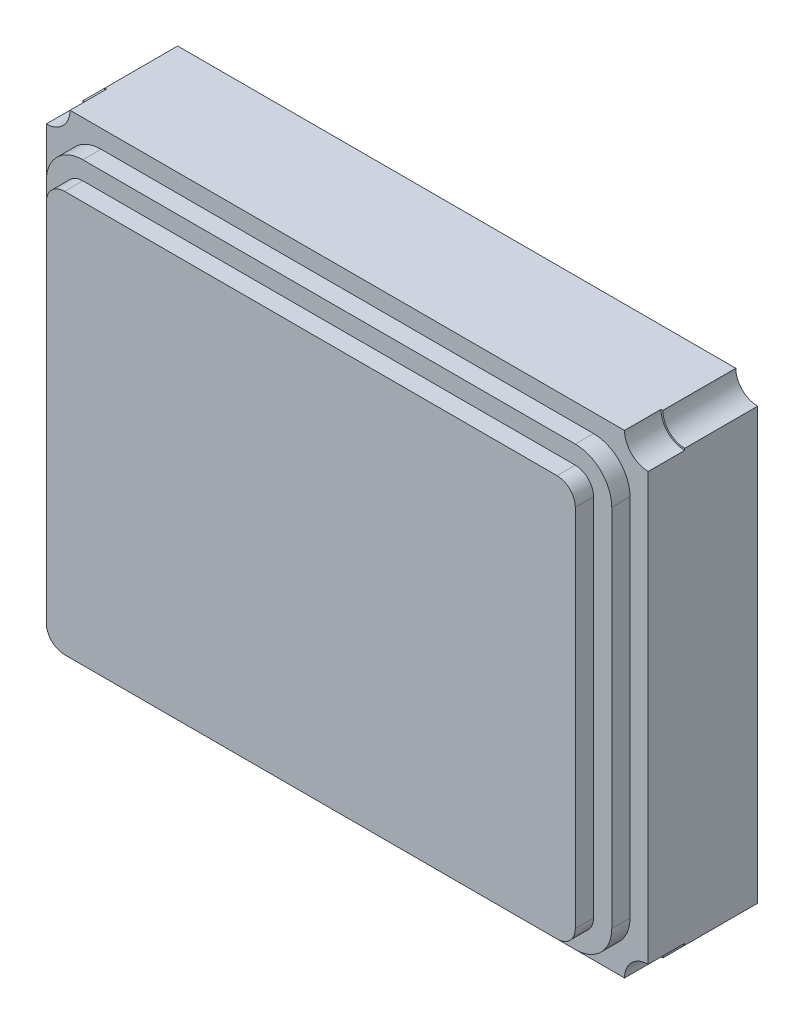
ISO-10303-21;
HEADER;
FILE_DESCRIPTION(('STEP AP214'),'2;1');
FILE_NAME('part.step','',(''),(''),'','','');
FILE_SCHEMA(('AUTOMOTIVE_DESIGN { 1 0 10303 214 1 1 1 1 }'));
ENDSEC;
DATA;
#1=APPLICATION_CONTEXT('core data for automotive mechanical design processes');
#2=APPLICATION_PROTOCOL_DEFINITION('international standard','automotive_design',2000,#1);
#3=PRODUCT_CONTEXT('',#1,'mechanical');
#4=PRODUCT('Part','Part','',(#3));
#5=PRODUCT_RELATED_PRODUCT_CATEGORY('part','',(#4));
#6=PRODUCT_DEFINITION_FORMATION('','',#4);
#7=PRODUCT_DEFINITION_CONTEXT('part definition',#1,'design');
#8=PRODUCT_DEFINITION('design','',#6,#7);
#9=PRODUCT_DEFINITION_SHAPE('','',#8);
#10=(LENGTH_UNIT() NAMED_UNIT(*) SI_UNIT(.MILLI.,.METRE.));
#11=(NAMED_UNIT(*) PLANE_ANGLE_UNIT() SI_UNIT($,.RADIAN.));
#12=(NAMED_UNIT(*) SI_UNIT($,.STERADIAN.) SOLID_ANGLE_UNIT());
#13=UNCERTAINTY_MEASURE_WITH_UNIT(LENGTH_MEASURE(1.E-05),#10,'distance_accuracy_value','');
#14=(GEOMETRIC_REPRESENTATION_CONTEXT(3) GLOBAL_UNCERTAINTY_ASSIGNED_CONTEXT((#13)) GLOBAL_UNIT_ASSIGNED_CONTEXT((#10,
#11,#12)) REPRESENTATION_CONTEXT('',''));
#15=CARTESIAN_POINT('',(0.,0.,0.));
#16=DIRECTION('',(0.,0.,1.));
#17=DIRECTION('',(1.,0.,0.));
#18=AXIS2_PLACEMENT_3D('',#15,#16,#17);
#19=CARTESIAN_POINT('',(1.65,-1.3,0.8));
#20=DIRECTION('',(0.,0.,-1.));
#21=DIRECTION('',(-1.,0.,0.));
#22=AXIS2_PLACEMENT_3D('',#19,#20,#21);
#23=CYLINDRICAL_SURFACE('',#22,0.12);
#24=DIRECTION('',(0.,0.,-1.));
#25=VECTOR('',#24,1.);
#26=CARTESIAN_POINT('',(1.65,-1.18,0.8));
#27=LINE('',#26,#25);
#28=CARTESIAN_POINT('',(1.65,-1.18,0.4));
#29=VERTEX_POINT('',#28);
#30=CARTESIAN_POINT('',(1.65,-1.18,0.));
#31=VERTEX_POINT('',#30);
#32=EDGE_CURVE('E11',#29,#31,#27,.T.);
#33=ORIENTED_EDGE('',*,*,#32,.F.);
#34=CARTESIAN_POINT('',(1.65,-1.3,0.4));
#35=DIRECTION('',(0.,0.,1.));
#36=DIRECTION('',(1.,0.,0.));
#37=AXIS2_PLACEMENT_3D('',#34,#35,#36);
#38=CIRCLE('',#37,0.12);
#39=CARTESIAN_POINT('',(1.53,-1.3,0.4));
#40=VERTEX_POINT('',#39);
#41=EDGE_CURVE('E24',#29,#40,#38,.T.);
#42=ORIENTED_EDGE('',*,*,#41,.T.);
#43=DIRECTION('',(0.,0.,-1.));
#44=VECTOR('',#43,1.);
#45=CARTESIAN_POINT('',(1.53,-1.3,0.8));
#46=LINE('',#45,#44);
#47=CARTESIAN_POINT('',(1.53,-1.3,0.));
#48=VERTEX_POINT('',#47);
#49=EDGE_CURVE('E492',#40,#48,#46,.T.);
#50=ORIENTED_EDGE('',*,*,#49,.T.);
#51=CARTESIAN_POINT('',(1.65,-1.3,0.));
#52=DIRECTION('',(0.,0.,1.));
#53=DIRECTION('',(1.,0.,0.));
#54=AXIS2_PLACEMENT_3D('',#51,#52,#53);
#55=CIRCLE('',#54,0.12);
#56=EDGE_CURVE('E37',#31,#48,#55,.T.);
#57=ORIENTED_EDGE('',*,*,#56,.F.);
#58=EDGE_LOOP('',(#33,#42,#50,#57));
#59=FACE_BOUND('',#58,.T.);
#60=ADVANCED_FACE('F17',(#59),#23,.F.);
#61=CARTESIAN_POINT('',(-1.65,1.3,0.8));
#62=DIRECTION('',(0.,0.,-1.));
#63=DIRECTION('',(-1.,0.,0.));
#64=AXIS2_PLACEMENT_3D('',#61,#62,#63);
#65=CYLINDRICAL_SURFACE('',#64,0.12);
#66=DIRECTION('',(0.,0.,-1.));
#67=VECTOR('',#66,1.);
#68=CARTESIAN_POINT('',(-1.65,1.18,0.8));
#69=LINE('',#68,#67);
#70=CARTESIAN_POINT('',(-1.65,1.18,0.4));
#71=VERTEX_POINT('',#70);
#72=CARTESIAN_POINT('',(-1.65,1.18,0.));
#73=VERTEX_POINT('',#72);
#74=EDGE_CURVE('E488',#71,#73,#69,.T.);
#75=ORIENTED_EDGE('',*,*,#74,.F.);
#76=CARTESIAN_POINT('',(-1.65,1.3,0.4));
#77=DIRECTION('',(0.,0.,1.));
#78=DIRECTION('',(1.,0.,0.));
#79=AXIS2_PLACEMENT_3D('',#76,#77,#78);
#80=CIRCLE('',#79,0.12);
#81=CARTESIAN_POINT('',(-1.53,1.3,0.4));
#82=VERTEX_POINT('',#81);
#83=EDGE_CURVE('E485',#71,#82,#80,.T.);
#84=ORIENTED_EDGE('',*,*,#83,.T.);
#85=DIRECTION('',(0.,0.,-1.));
#86=VECTOR('',#85,1.);
#87=CARTESIAN_POINT('',(-1.53,1.3,0.8));
#88=LINE('',#87,#86);
#89=CARTESIAN_POINT('',(-1.53,1.3,0.));
#90=VERTEX_POINT('',#89);
#91=EDGE_CURVE('E482',#82,#90,#88,.T.);
#92=ORIENTED_EDGE('',*,*,#91,.T.);
#93=CARTESIAN_POINT('',(-1.65,1.3,0.));
#94=DIRECTION('',(0.,0.,1.));
#95=DIRECTION('',(1.,0.,0.));
#96=AXIS2_PLACEMENT_3D('',#93,#94,#95);
#97=CIRCLE('',#96,0.12);
#98=EDGE_CURVE('E480',#73,#90,#97,.T.);
#99=ORIENTED_EDGE('',*,*,#98,.F.);
#100=EDGE_LOOP('',(#75,#84,#92,#99));
#101=FACE_BOUND('',#100,.T.);
#102=ADVANCED_FACE('F531',(#101),#65,.F.);
#103=CARTESIAN_POINT('',(1.65,1.3,0.8));
#104=DIRECTION('',(0.,0.,-1.));
#105=DIRECTION('',(-1.,0.,0.));
#106=AXIS2_PLACEMENT_3D('',#103,#104,#105);
#107=CYLINDRICAL_SURFACE('',#106,0.12);
#108=DIRECTION('',(0.,0.,-1.));
#109=VECTOR('',#108,1.);
#110=CARTESIAN_POINT('',(1.53,1.3,0.8));
#111=LINE('',#110,#109);
#112=CARTESIAN_POINT('',(1.53,1.3,0.4));
#113=VERTEX_POINT('',#112);
#114=CARTESIAN_POINT('',(1.53,1.3,0.));
#115=VERTEX_POINT('',#114);
#116=EDGE_CURVE('E477',#113,#115,#111,.T.);
#117=ORIENTED_EDGE('',*,*,#116,.F.);
#118=CARTESIAN_POINT('',(1.65,1.3,0.4));
#119=DIRECTION('',(0.,0.,1.));
#120=DIRECTION('',(1.,0.,0.));
#121=AXIS2_PLACEMENT_3D('',#118,#119,#120);
#122=CIRCLE('',#121,0.12);
#123=CARTESIAN_POINT('',(1.65,1.18,0.4));
#124=VERTEX_POINT('',#123);
#125=EDGE_CURVE('E474',#113,#124,#122,.T.);
#126=ORIENTED_EDGE('',*,*,#125,.T.);
#127=DIRECTION('',(0.,0.,-1.));
#128=VECTOR('',#127,1.);
#129=CARTESIAN_POINT('',(1.65,1.18,0.8));
#130=LINE('',#129,#128);
#131=CARTESIAN_POINT('',(1.65,1.18,0.));
#132=VERTEX_POINT('',#131);
#133=EDGE_CURVE('E471',#124,#132,#130,.T.);
#134=ORIENTED_EDGE('',*,*,#133,.T.);
#135=CARTESIAN_POINT('',(1.65,1.3,0.));
#136=DIRECTION('',(0.,0.,1.));
#137=DIRECTION('',(1.,0.,0.));
#138=AXIS2_PLACEMENT_3D('',#135,#136,#137);
#139=CIRCLE('',#138,0.12);
#140=EDGE_CURVE('E469',#115,#132,#139,.T.);
#141=ORIENTED_EDGE('',*,*,#140,.F.);
#142=EDGE_LOOP('',(#117,#126,#134,#141));
#143=FACE_BOUND('',#142,.T.);
#144=ADVANCED_FACE('F527',(#143),#107,.F.);
#145=CARTESIAN_POINT('',(0.,0.,0.7));
#146=DIRECTION('',(0.,0.,1.));
#147=DIRECTION('',(1.,0.,0.));
#148=AXIS2_PLACEMENT_3D('',#145,#146,#147);
#149=PLANE('',#148);
#150=DIRECTION('',(1.,0.,0.));
#151=VECTOR('',#150,1.);
#152=CARTESIAN_POINT('',(-1.35,-1.1,0.7));
#153=LINE('',#152,#151);
#154=CARTESIAN_POINT('',(-1.35,-1.1,0.7));
#155=VERTEX_POINT('',#154);
#156=CARTESIAN_POINT('',(1.35,-1.1,0.7));
#157=VERTEX_POINT('',#156);
#158=EDGE_CURVE('E467',#155,#157,#153,.T.);
#159=ORIENTED_EDGE('',*,*,#158,.F.);
#160=CARTESIAN_POINT('',(-1.35,-1.,0.7));
#161=DIRECTION('',(0.,0.,1.));
#162=DIRECTION('',(-1.,0.,0.));
#163=AXIS2_PLACEMENT_3D('',#160,#161,#162);
#164=CIRCLE('',#163,0.0999999999999998);
#165=CARTESIAN_POINT('',(-1.45,-1.,0.7));
#166=VERTEX_POINT('',#165);
#167=EDGE_CURVE('E464',#166,#155,#164,.T.);
#168=ORIENTED_EDGE('',*,*,#167,.F.);
#169=DIRECTION('',(0.,-1.,0.));
#170=VECTOR('',#169,1.);
#171=CARTESIAN_POINT('',(-1.45,-1.,0.7));
#172=LINE('',#171,#170);
#173=CARTESIAN_POINT('',(-1.45,1.,0.7));
#174=VERTEX_POINT('',#173);
#175=EDGE_CURVE('E461',#174,#166,#172,.T.);
#176=ORIENTED_EDGE('',*,*,#175,.F.);
#177=CARTESIAN_POINT('',(-1.35,1.,0.7));
#178=DIRECTION('',(0.,0.,1.));
#179=DIRECTION('',(-1.,0.,0.));
#180=AXIS2_PLACEMENT_3D('',#177,#178,#179);
#181=CIRCLE('',#180,0.0999999999999998);
#182=CARTESIAN_POINT('',(-1.35,1.1,0.7));
#183=VERTEX_POINT('',#182);
#184=EDGE_CURVE('E458',#183,#174,#181,.T.);
#185=ORIENTED_EDGE('',*,*,#184,.F.);
#186=DIRECTION('',(-1.,0.,0.));
#187=VECTOR('',#186,1.);
#188=CARTESIAN_POINT('',(-1.35,1.1,0.7));
#189=LINE('',#188,#187);
#190=CARTESIAN_POINT('',(1.35,1.1,0.7));
#191=VERTEX_POINT('',#190);
#192=EDGE_CURVE('E455',#191,#183,#189,.T.);
#193=ORIENTED_EDGE('',*,*,#192,.F.);
#194=CARTESIAN_POINT('',(1.35,1.,0.7));
#195=DIRECTION('',(0.,0.,1.));
#196=DIRECTION('',(-1.,0.,0.));
#197=AXIS2_PLACEMENT_3D('',#194,#195,#196);
#198=CIRCLE('',#197,0.0999999999999998);
#199=CARTESIAN_POINT('',(1.45,1.,0.7));
#200=VERTEX_POINT('',#199);
#201=EDGE_CURVE('E452',#200,#191,#198,.T.);
#202=ORIENTED_EDGE('',*,*,#201,.F.);
#203=DIRECTION('',(0.,1.,0.));
#204=VECTOR('',#203,1.);
#205=CARTESIAN_POINT('',(1.45,-1.,0.7));
#206=LINE('',#205,#204);
#207=CARTESIAN_POINT('',(1.45,-1.,0.7));
#208=VERTEX_POINT('',#207);
#209=EDGE_CURVE('E449',#208,#200,#206,.T.);
#210=ORIENTED_EDGE('',*,*,#209,.F.);
#211=CARTESIAN_POINT('',(1.35,-1.,0.7));
#212=DIRECTION('',(0.,0.,1.));
#213=DIRECTION('',(1.,0.,0.));
#214=AXIS2_PLACEMENT_3D('',#211,#212,#213);
#215=CIRCLE('',#214,0.0999999999999998);
#216=EDGE_CURVE('E446',#157,#208,#215,.T.);
#217=ORIENTED_EDGE('',*,*,#216,.F.);
#218=EDGE_LOOP('',(#159,#168,#176,#185,#193,#202,#210,#217));
#219=FACE_BOUND('',#218,.T.);
#220=DIRECTION('',(1.,0.,0.));
#221=VECTOR('',#220,1.);
#222=CARTESIAN_POINT('',(0.,-1.2,0.7));
#223=LINE('',#222,#221);
#224=CARTESIAN_POINT('',(-1.35,-1.2,0.7));
#225=VERTEX_POINT('',#224);
#226=CARTESIAN_POINT('',(1.35,-1.2,0.7));
#227=VERTEX_POINT('',#226);
#228=EDGE_CURVE('E444',#225,#227,#223,.T.);
#229=ORIENTED_EDGE('',*,*,#228,.T.);
#230=CARTESIAN_POINT('',(1.35,-1.,0.7));
#231=DIRECTION('',(0.,0.,1.));
#232=DIRECTION('',(1.,0.,0.));
#233=AXIS2_PLACEMENT_3D('',#230,#231,#232);
#234=CIRCLE('',#233,0.199999999999999);
#235=CARTESIAN_POINT('',(1.55,-1.,0.7));
#236=VERTEX_POINT('',#235);
#237=EDGE_CURVE('E442',#227,#236,#234,.T.);
#238=ORIENTED_EDGE('',*,*,#237,.T.);
#239=DIRECTION('',(0.,1.,0.));
#240=VECTOR('',#239,1.);
#241=CARTESIAN_POINT('',(1.55,0.,0.7));
#242=LINE('',#241,#240);
#243=CARTESIAN_POINT('',(1.55,1.,0.7));
#244=VERTEX_POINT('',#243);
#245=EDGE_CURVE('E440',#236,#244,#242,.T.);
#246=ORIENTED_EDGE('',*,*,#245,.T.);
#247=CARTESIAN_POINT('',(1.35,1.,0.7));
#248=DIRECTION('',(0.,0.,1.));
#249=DIRECTION('',(1.,0.,0.));
#250=AXIS2_PLACEMENT_3D('',#247,#248,#249);
#251=CIRCLE('',#250,0.199999999999999);
#252=CARTESIAN_POINT('',(1.35,1.2,0.7));
#253=VERTEX_POINT('',#252);
#254=EDGE_CURVE('E438',#244,#253,#251,.T.);
#255=ORIENTED_EDGE('',*,*,#254,.T.);
#256=DIRECTION('',(-1.,0.,0.));
#257=VECTOR('',#256,1.);
#258=CARTESIAN_POINT('',(0.,1.2,0.7));
#259=LINE('',#258,#257);
#260=CARTESIAN_POINT('',(-1.35,1.2,0.7));
#261=VERTEX_POINT('',#260);
#262=EDGE_CURVE('E436',#253,#261,#259,.T.);
#263=ORIENTED_EDGE('',*,*,#262,.T.);
#264=CARTESIAN_POINT('',(-1.35,1.,0.7));
#265=DIRECTION('',(0.,0.,1.));
#266=DIRECTION('',(1.,0.,0.));
#267=AXIS2_PLACEMENT_3D('',#264,#265,#266);
#268=CIRCLE('',#267,0.199999999999999);
#269=CARTESIAN_POINT('',(-1.55,1.,0.7));
#270=VERTEX_POINT('',#269);
#271=EDGE_CURVE('E434',#261,#270,#268,.T.);
#272=ORIENTED_EDGE('',*,*,#271,.T.);
#273=DIRECTION('',(0.,-1.,0.));
#274=VECTOR('',#273,1.);
#275=CARTESIAN_POINT('',(-1.55,0.,0.7));
#276=LINE('',#275,#274);
#277=CARTESIAN_POINT('',(-1.55,-1.,0.7));
#278=VERTEX_POINT('',#277);
#279=EDGE_CURVE('E432',#270,#278,#276,.T.);
#280=ORIENTED_EDGE('',*,*,#279,.T.);
#281=CARTESIAN_POINT('',(-1.35,-1.,0.7));
#282=DIRECTION('',(0.,0.,1.));
#283=DIRECTION('',(1.,0.,0.));
#284=AXIS2_PLACEMENT_3D('',#281,#282,#283);
#285=CIRCLE('',#284,0.199999999999999);
#286=EDGE_CURVE('E429',#278,#225,#285,.T.);
#287=ORIENTED_EDGE('',*,*,#286,.T.);
#288=EDGE_LOOP('',(#229,#238,#246,#255,#263,#272,#280,#287));
#289=FACE_BOUND('',#288,.T.);
#290=ADVANCED_FACE('F555',(#219,#289),#149,.T.);
#291=CARTESIAN_POINT('',(1.35,-1.,0.7));
#292=DIRECTION('',(0.,0.,1.));
#293=DIRECTION('',(1.,0.,0.));
#294=AXIS2_PLACEMENT_3D('',#291,#292,#293);
#295=CYLINDRICAL_SURFACE('',#294,0.0999999999999998);
#296=CARTESIAN_POINT('',(1.35,-1.,0.8));
#297=DIRECTION('',(0.,0.,1.));
#298=DIRECTION('',(1.,0.,0.));
#299=AXIS2_PLACEMENT_3D('',#296,#297,#298);
#300=CIRCLE('',#299,0.0999999999999998);
#301=CARTESIAN_POINT('',(1.35,-1.1,0.8));
#302=VERTEX_POINT('',#301);
#303=CARTESIAN_POINT('',(1.45,-1.,0.8));
#304=VERTEX_POINT('',#303);
#305=EDGE_CURVE('E427',#302,#304,#300,.T.);
#306=ORIENTED_EDGE('',*,*,#305,.F.);
#307=DIRECTION('',(0.,0.,1.));
#308=VECTOR('',#307,1.);
#309=CARTESIAN_POINT('',(1.35,-1.1,0.7));
#310=LINE('',#309,#308);
#311=EDGE_CURVE('E424',#157,#302,#310,.T.);
#312=ORIENTED_EDGE('',*,*,#311,.F.);
#313=ORIENTED_EDGE('',*,*,#216,.T.);
#314=DIRECTION('',(0.,0.,1.));
#315=VECTOR('',#314,1.);
#316=CARTESIAN_POINT('',(1.45,-1.,0.7));
#317=LINE('',#316,#315);
#318=EDGE_CURVE('E421',#208,#304,#317,.T.);
#319=ORIENTED_EDGE('',*,*,#318,.T.);
#320=EDGE_LOOP('',(#306,#312,#313,#319));
#321=FACE_BOUND('',#320,.T.);
#322=ADVANCED_FACE('F560',(#321),#295,.T.);
#323=CARTESIAN_POINT('',(-1.35,-1.1,0.7));
#324=DIRECTION('',(0.,-1.,0.));
#325=DIRECTION('',(0.,0.,-1.));
#326=AXIS2_PLACEMENT_3D('',#323,#324,#325);
#327=PLANE('',#326);
#328=DIRECTION('',(1.,0.,0.));
#329=VECTOR('',#328,1.);
#330=CARTESIAN_POINT('',(-1.35,-1.1,0.8));
#331=LINE('',#330,#329);
#332=CARTESIAN_POINT('',(-1.35,-1.1,0.8));
#333=VERTEX_POINT('',#332);
#334=EDGE_CURVE('E418',#333,#302,#331,.T.);
#335=ORIENTED_EDGE('',*,*,#334,.F.);
#336=DIRECTION('',(0.,0.,1.));
#337=VECTOR('',#336,1.);
#338=CARTESIAN_POINT('',(-1.35,-1.1,0.7));
#339=LINE('',#338,#337);
#340=EDGE_CURVE('E415',#155,#333,#339,.T.);
#341=ORIENTED_EDGE('',*,*,#340,.F.);
#342=ORIENTED_EDGE('',*,*,#158,.T.);
#343=ORIENTED_EDGE('',*,*,#311,.T.);
#344=EDGE_LOOP('',(#335,#341,#342,#343));
#345=FACE_BOUND('',#344,.T.);
#346=ADVANCED_FACE('F564',(#345),#327,.T.);
#347=CARTESIAN_POINT('',(-1.35,-1.,0.7));
#348=DIRECTION('',(0.,0.,1.));
#349=DIRECTION('',(1.,0.,0.));
#350=AXIS2_PLACEMENT_3D('',#347,#348,#349);
#351=CYLINDRICAL_SURFACE('',#350,0.0999999999999998);
#352=CARTESIAN_POINT('',(-1.35,-1.,0.8));
#353=DIRECTION('',(0.,0.,1.));
#354=DIRECTION('',(-1.,0.,0.));
#355=AXIS2_PLACEMENT_3D('',#352,#353,#354);
#356=CIRCLE('',#355,0.0999999999999998);
#357=CARTESIAN_POINT('',(-1.45,-1.,0.8));
#358=VERTEX_POINT('',#357);
#359=EDGE_CURVE('E412',#358,#333,#356,.T.);
#360=ORIENTED_EDGE('',*,*,#359,.F.);
#361=DIRECTION('',(0.,0.,1.));
#362=VECTOR('',#361,1.);
#363=CARTESIAN_POINT('',(-1.45,-1.,0.7));
#364=LINE('',#363,#362);
#365=EDGE_CURVE('E409',#166,#358,#364,.T.);
#366=ORIENTED_EDGE('',*,*,#365,.F.);
#367=ORIENTED_EDGE('',*,*,#167,.T.);
#368=ORIENTED_EDGE('',*,*,#340,.T.);
#369=EDGE_LOOP('',(#360,#366,#367,#368));
#370=FACE_BOUND('',#369,.T.);
#371=ADVANCED_FACE('F568',(#370),#351,.T.);
#372=CARTESIAN_POINT('',(-1.45,-1.,0.7));
#373=DIRECTION('',(-1.,0.,0.));
#374=DIRECTION('',(0.,0.,1.));
#375=AXIS2_PLACEMENT_3D('',#372,#373,#374);
#376=PLANE('',#375);
#377=DIRECTION('',(0.,-1.,0.));
#378=VECTOR('',#377,1.);
#379=CARTESIAN_POINT('',(-1.45,-1.,0.8));
#380=LINE('',#379,#378);
#381=CARTESIAN_POINT('',(-1.45,1.,0.8));
#382=VERTEX_POINT('',#381);
#383=EDGE_CURVE('E406',#382,#358,#380,.T.);
#384=ORIENTED_EDGE('',*,*,#383,.F.);
#385=DIRECTION('',(0.,0.,1.));
#386=VECTOR('',#385,1.);
#387=CARTESIAN_POINT('',(-1.45,1.,0.7));
#388=LINE('',#387,#386);
#389=EDGE_CURVE('E403',#174,#382,#388,.T.);
#390=ORIENTED_EDGE('',*,*,#389,.F.);
#391=ORIENTED_EDGE('',*,*,#175,.T.);
#392=ORIENTED_EDGE('',*,*,#365,.T.);
#393=EDGE_LOOP('',(#384,#390,#391,#392));
#394=FACE_BOUND('',#393,.T.);
#395=ADVANCED_FACE('F572',(#394),#376,.T.);
#396=CARTESIAN_POINT('',(-1.35,1.,0.7));
#397=DIRECTION('',(0.,0.,1.));
#398=DIRECTION('',(1.,0.,0.));
#399=AXIS2_PLACEMENT_3D('',#396,#397,#398);
#400=CYLINDRICAL_SURFACE('',#399,0.0999999999999998);
#401=CARTESIAN_POINT('',(-1.35,1.,0.8));
#402=DIRECTION('',(0.,0.,1.));
#403=DIRECTION('',(-1.,0.,0.));
#404=AXIS2_PLACEMENT_3D('',#401,#402,#403);
#405=CIRCLE('',#404,0.0999999999999998);
#406=CARTESIAN_POINT('',(-1.35,1.1,0.8));
#407=VERTEX_POINT('',#406);
#408=EDGE_CURVE('E400',#407,#382,#405,.T.);
#409=ORIENTED_EDGE('',*,*,#408,.F.);
#410=DIRECTION('',(0.,0.,1.));
#411=VECTOR('',#410,1.);
#412=CARTESIAN_POINT('',(-1.35,1.1,0.7));
#413=LINE('',#412,#411);
#414=EDGE_CURVE('E397',#183,#407,#413,.T.);
#415=ORIENTED_EDGE('',*,*,#414,.F.);
#416=ORIENTED_EDGE('',*,*,#184,.T.);
#417=ORIENTED_EDGE('',*,*,#389,.T.);
#418=EDGE_LOOP('',(#409,#415,#416,#417));
#419=FACE_BOUND('',#418,.T.);
#420=ADVANCED_FACE('F576',(#419),#400,.T.);
#421=CARTESIAN_POINT('',(-1.35,1.1,0.7));
#422=DIRECTION('',(0.,1.,0.));
#423=DIRECTION('',(0.,0.,1.));
#424=AXIS2_PLACEMENT_3D('',#421,#422,#423);
#425=PLANE('',#424);
#426=DIRECTION('',(-1.,0.,0.));
#427=VECTOR('',#426,1.);
#428=CARTESIAN_POINT('',(-1.35,1.1,0.8));
#429=LINE('',#428,#427);
#430=CARTESIAN_POINT('',(1.35,1.1,0.8));
#431=VERTEX_POINT('',#430);
#432=EDGE_CURVE('E394',#431,#407,#429,.T.);
#433=ORIENTED_EDGE('',*,*,#432,.F.);
#434=DIRECTION('',(0.,0.,1.));
#435=VECTOR('',#434,1.);
#436=CARTESIAN_POINT('',(1.35,1.1,0.7));
#437=LINE('',#436,#435);
#438=EDGE_CURVE('E391',#191,#431,#437,.T.);
#439=ORIENTED_EDGE('',*,*,#438,.F.);
#440=ORIENTED_EDGE('',*,*,#192,.T.);
#441=ORIENTED_EDGE('',*,*,#414,.T.);
#442=EDGE_LOOP('',(#433,#439,#440,#441));
#443=FACE_BOUND('',#442,.T.);
#444=ADVANCED_FACE('F580',(#443),#425,.T.);
#445=CARTESIAN_POINT('',(1.35,1.,0.7));
#446=DIRECTION('',(0.,0.,1.));
#447=DIRECTION('',(1.,0.,0.));
#448=AXIS2_PLACEMENT_3D('',#445,#446,#447);
#449=CYLINDRICAL_SURFACE('',#448,0.0999999999999998);
#450=CARTESIAN_POINT('',(1.35,1.,0.8));
#451=DIRECTION('',(0.,0.,1.));
#452=DIRECTION('',(-1.,0.,0.));
#453=AXIS2_PLACEMENT_3D('',#450,#451,#452);
#454=CIRCLE('',#453,0.0999999999999998);
#455=CARTESIAN_POINT('',(1.45,1.,0.8));
#456=VERTEX_POINT('',#455);
#457=EDGE_CURVE('E388',#456,#431,#454,.T.);
#458=ORIENTED_EDGE('',*,*,#457,.F.);
#459=DIRECTION('',(0.,0.,1.));
#460=VECTOR('',#459,1.);
#461=CARTESIAN_POINT('',(1.45,1.,0.7));
#462=LINE('',#461,#460);
#463=EDGE_CURVE('E385',#200,#456,#462,.T.);
#464=ORIENTED_EDGE('',*,*,#463,.F.);
#465=ORIENTED_EDGE('',*,*,#201,.T.);
#466=ORIENTED_EDGE('',*,*,#438,.T.);
#467=EDGE_LOOP('',(#458,#464,#465,#466));
#468=FACE_BOUND('',#467,.T.);
#469=ADVANCED_FACE('F584',(#468),#449,.T.);
#470=CARTESIAN_POINT('',(1.45,-1.,0.7));
#471=DIRECTION('',(1.,0.,0.));
#472=DIRECTION('',(0.,0.,-1.));
#473=AXIS2_PLACEMENT_3D('',#470,#471,#472);
#474=PLANE('',#473);
#475=DIRECTION('',(0.,1.,0.));
#476=VECTOR('',#475,1.);
#477=CARTESIAN_POINT('',(1.45,-1.,0.8));
#478=LINE('',#477,#476);
#479=EDGE_CURVE('E382',#304,#456,#478,.T.);
#480=ORIENTED_EDGE('',*,*,#479,.F.);
#481=ORIENTED_EDGE('',*,*,#318,.F.);
#482=ORIENTED_EDGE('',*,*,#209,.T.);
#483=ORIENTED_EDGE('',*,*,#463,.T.);
#484=EDGE_LOOP('',(#480,#481,#482,#483));
#485=FACE_BOUND('',#484,.T.);
#486=ADVANCED_FACE('F588',(#485),#474,.T.);
#487=CARTESIAN_POINT('',(0.,0.,0.8));
#488=DIRECTION('',(0.,0.,1.));
#489=DIRECTION('',(1.,0.,0.));
#490=AXIS2_PLACEMENT_3D('',#487,#488,#489);
#491=PLANE('',#490);
#492=ORIENTED_EDGE('',*,*,#334,.T.);
#493=ORIENTED_EDGE('',*,*,#305,.T.);
#494=ORIENTED_EDGE('',*,*,#479,.T.);
#495=ORIENTED_EDGE('',*,*,#457,.T.);
#496=ORIENTED_EDGE('',*,*,#432,.T.);
#497=ORIENTED_EDGE('',*,*,#408,.T.);
#498=ORIENTED_EDGE('',*,*,#383,.T.);
#499=ORIENTED_EDGE('',*,*,#359,.T.);
#500=EDGE_LOOP('',(#492,#493,#494,#495,#496,#497,#498,#499));
#501=FACE_BOUND('',#500,.T.);
#502=ADVANCED_FACE('F592',(#501),#491,.T.);
#503=CARTESIAN_POINT('',(0.,0.,0.6));
#504=DIRECTION('',(0.,0.,1.));
#505=DIRECTION('',(1.,0.,0.));
#506=AXIS2_PLACEMENT_3D('',#503,#504,#505);
#507=PLANE('',#506);
#508=CARTESIAN_POINT('',(1.65,-1.3,0.6));
#509=DIRECTION('',(0.,0.,1.));
#510=DIRECTION('',(1.,0.,0.));
#511=AXIS2_PLACEMENT_3D('',#508,#509,#510);
#512=CIRCLE('',#511,0.13);
#513=CARTESIAN_POINT('',(1.65,-1.17,0.6));
#514=VERTEX_POINT('',#513);
#515=CARTESIAN_POINT('',(1.52,-1.3,0.6));
#516=VERTEX_POINT('',#515);
#517=EDGE_CURVE('E380',#514,#516,#512,.T.);
#518=ORIENTED_EDGE('',*,*,#517,.F.);
#519=DIRECTION('',(0.,1.,0.));
#520=VECTOR('',#519,1.);
#521=CARTESIAN_POINT('',(1.65,0.,0.6));
#522=LINE('',#521,#520);
#523=CARTESIAN_POINT('',(1.65,1.17,0.6));
#524=VERTEX_POINT('',#523);
#525=EDGE_CURVE('E378',#514,#524,#522,.T.);
#526=ORIENTED_EDGE('',*,*,#525,.T.);
#527=CARTESIAN_POINT('',(1.65,1.3,0.6));
#528=DIRECTION('',(0.,0.,1.));
#529=DIRECTION('',(1.,0.,0.));
#530=AXIS2_PLACEMENT_3D('',#527,#528,#529);
#531=CIRCLE('',#530,0.13);
#532=CARTESIAN_POINT('',(1.52,1.3,0.6));
#533=VERTEX_POINT('',#532);
#534=EDGE_CURVE('E375',#533,#524,#531,.T.);
#535=ORIENTED_EDGE('',*,*,#534,.F.);
#536=DIRECTION('',(1.,0.,0.));
#537=VECTOR('',#536,1.);
#538=CARTESIAN_POINT('',(0.,1.3,0.6));
#539=LINE('',#538,#537);
#540=CARTESIAN_POINT('',(-1.52,1.3,0.6));
#541=VERTEX_POINT('',#540);
#542=EDGE_CURVE('E372',#541,#533,#539,.T.);
#543=ORIENTED_EDGE('',*,*,#542,.F.);
#544=CARTESIAN_POINT('',(-1.65,1.3,0.6));
#545=DIRECTION('',(0.,0.,1.));
#546=DIRECTION('',(1.,0.,0.));
#547=AXIS2_PLACEMENT_3D('',#544,#545,#546);
#548=CIRCLE('',#547,0.13);
#549=CARTESIAN_POINT('',(-1.65,1.17,0.6));
#550=VERTEX_POINT('',#549);
#551=EDGE_CURVE('E369',#550,#541,#548,.T.);
#552=ORIENTED_EDGE('',*,*,#551,.F.);
#553=DIRECTION('',(0.,1.,0.));
#554=VECTOR('',#553,1.);
#555=CARTESIAN_POINT('',(-1.65,0.,0.6));
#556=LINE('',#555,#554);
#557=CARTESIAN_POINT('',(-1.65,-1.17,0.6));
#558=VERTEX_POINT('',#557);
#559=EDGE_CURVE('E367',#558,#550,#556,.T.);
#560=ORIENTED_EDGE('',*,*,#559,.F.);
#561=CARTESIAN_POINT('',(-1.65,-1.3,0.6));
#562=DIRECTION('',(0.,0.,1.));
#563=DIRECTION('',(-1.,0.,0.));
#564=AXIS2_PLACEMENT_3D('',#561,#562,#563);
#565=CIRCLE('',#564,0.13);
#566=CARTESIAN_POINT('',(-1.52,-1.3,0.6));
#567=VERTEX_POINT('',#566);
#568=EDGE_CURVE('E244',#567,#558,#565,.T.);
#569=ORIENTED_EDGE('',*,*,#568,.F.);
#570=DIRECTION('',(1.,0.,0.));
#571=VECTOR('',#570,1.);
#572=CARTESIAN_POINT('',(0.,-1.3,0.6));
#573=LINE('',#572,#571);
#574=EDGE_CURVE('E363',#567,#516,#573,.T.);
#575=ORIENTED_EDGE('',*,*,#574,.T.);
#576=EDGE_LOOP('',(#518,#526,#535,#543,#552,#560,#569,#575));
#577=FACE_BOUND('',#576,.T.);
#578=DIRECTION('',(1.,0.,0.));
#579=VECTOR('',#578,1.);
#580=CARTESIAN_POINT('',(-1.35,-1.2,0.6));
#581=LINE('',#580,#579);
#582=CARTESIAN_POINT('',(-1.35,-1.2,0.6));
#583=VERTEX_POINT('',#582);
#584=CARTESIAN_POINT('',(1.35,-1.2,0.6));
#585=VERTEX_POINT('',#584);
#586=EDGE_CURVE('E361',#583,#585,#581,.T.);
#587=ORIENTED_EDGE('',*,*,#586,.F.);
#588=CARTESIAN_POINT('',(-1.35,-1.,0.6));
#589=DIRECTION('',(0.,0.,1.));
#590=DIRECTION('',(-1.,0.,0.));
#591=AXIS2_PLACEMENT_3D('',#588,#589,#590);
#592=CIRCLE('',#591,0.199999999999999);
#593=CARTESIAN_POINT('',(-1.55,-1.,0.6));
#594=VERTEX_POINT('',#593);
#595=EDGE_CURVE('E358',#594,#583,#592,.T.);
#596=ORIENTED_EDGE('',*,*,#595,.F.);
#597=DIRECTION('',(0.,-1.,0.));
#598=VECTOR('',#597,1.);
#599=CARTESIAN_POINT('',(-1.55,-1.,0.6));
#600=LINE('',#599,#598);
#601=CARTESIAN_POINT('',(-1.55,1.,0.6));
#602=VERTEX_POINT('',#601);
#603=EDGE_CURVE('E355',#602,#594,#600,.T.);
#604=ORIENTED_EDGE('',*,*,#603,.F.);
#605=CARTESIAN_POINT('',(-1.35,1.,0.6));
#606=DIRECTION('',(0.,0.,1.));
#607=DIRECTION('',(-1.,0.,0.));
#608=AXIS2_PLACEMENT_3D('',#605,#606,#607);
#609=CIRCLE('',#608,0.199999999999999);
#610=CARTESIAN_POINT('',(-1.35,1.2,0.6));
#611=VERTEX_POINT('',#610);
#612=EDGE_CURVE('E352',#611,#602,#609,.T.);
#613=ORIENTED_EDGE('',*,*,#612,.F.);
#614=DIRECTION('',(-1.,0.,0.));
#615=VECTOR('',#614,1.);
#616=CARTESIAN_POINT('',(-1.35,1.2,0.6));
#617=LINE('',#616,#615);
#618=CARTESIAN_POINT('',(1.35,1.2,0.6));
#619=VERTEX_POINT('',#618);
#620=EDGE_CURVE('E349',#619,#611,#617,.T.);
#621=ORIENTED_EDGE('',*,*,#620,.F.);
#622=CARTESIAN_POINT('',(1.35,1.,0.6));
#623=DIRECTION('',(0.,0.,1.));
#624=DIRECTION('',(-1.,0.,0.));
#625=AXIS2_PLACEMENT_3D('',#622,#623,#624);
#626=CIRCLE('',#625,0.199999999999999);
#627=CARTESIAN_POINT('',(1.55,1.,0.6));
#628=VERTEX_POINT('',#627);
#629=EDGE_CURVE('E346',#628,#619,#626,.T.);
#630=ORIENTED_EDGE('',*,*,#629,.F.);
#631=DIRECTION('',(0.,1.,0.));
#632=VECTOR('',#631,1.);
#633=CARTESIAN_POINT('',(1.55,-1.,0.6));
#634=LINE('',#633,#632);
#635=CARTESIAN_POINT('',(1.55,-1.,0.6));
#636=VERTEX_POINT('',#635);
#637=EDGE_CURVE('E343',#636,#628,#634,.T.);
#638=ORIENTED_EDGE('',*,*,#637,.F.);
#639=CARTESIAN_POINT('',(1.35,-1.,0.6));
#640=DIRECTION('',(0.,0.,1.));
#641=DIRECTION('',(1.,0.,0.));
#642=AXIS2_PLACEMENT_3D('',#639,#640,#641);
#643=CIRCLE('',#642,0.199999999999999);
#644=EDGE_CURVE('E340',#585,#636,#643,.T.);
#645=ORIENTED_EDGE('',*,*,#644,.F.);
#646=EDGE_LOOP('',(#587,#596,#604,#613,#621,#630,#638,#645));
#647=FACE_BOUND('',#646,.T.);
#648=ADVANCED_FACE('F505',(#577,#647),#507,.T.);
#649=CARTESIAN_POINT('',(1.35,-1.,0.6));
#650=DIRECTION('',(0.,0.,1.));
#651=DIRECTION('',(1.,0.,0.));
#652=AXIS2_PLACEMENT_3D('',#649,#650,#651);
#653=CYLINDRICAL_SURFACE('',#652,0.199999999999999);
#654=DIRECTION('',(0.,0.,1.));
#655=VECTOR('',#654,1.);
#656=CARTESIAN_POINT('',(1.35,-1.2,0.6));
#657=LINE('',#656,#655);
#658=EDGE_CURVE('E337',#585,#227,#657,.T.);
#659=ORIENTED_EDGE('',*,*,#658,.F.);
#660=ORIENTED_EDGE('',*,*,#644,.T.);
#661=DIRECTION('',(0.,0.,1.));
#662=VECTOR('',#661,1.);
#663=CARTESIAN_POINT('',(1.55,-1.,0.6));
#664=LINE('',#663,#662);
#665=EDGE_CURVE('E334',#636,#236,#664,.T.);
#666=ORIENTED_EDGE('',*,*,#665,.T.);
#667=ORIENTED_EDGE('',*,*,#237,.F.);
#668=EDGE_LOOP('',(#659,#660,#666,#667));
#669=FACE_BOUND('',#668,.T.);
#670=ADVANCED_FACE('F599',(#669),#653,.T.);
#671=CARTESIAN_POINT('',(-1.35,-1.2,0.6));
#672=DIRECTION('',(0.,-1.,0.));
#673=DIRECTION('',(0.,0.,-1.));
#674=AXIS2_PLACEMENT_3D('',#671,#672,#673);
#675=PLANE('',#674);
#676=DIRECTION('',(0.,0.,1.));
#677=VECTOR('',#676,1.);
#678=CARTESIAN_POINT('',(-1.35,-1.2,0.6));
#679=LINE('',#678,#677);
#680=EDGE_CURVE('E331',#583,#225,#679,.T.);
#681=ORIENTED_EDGE('',*,*,#680,.F.);
#682=ORIENTED_EDGE('',*,*,#586,.T.);
#683=ORIENTED_EDGE('',*,*,#658,.T.);
#684=ORIENTED_EDGE('',*,*,#228,.F.);
#685=EDGE_LOOP('',(#681,#682,#683,#684));
#686=FACE_BOUND('',#685,.T.);
#687=ADVANCED_FACE('F602',(#686),#675,.T.);
#688=CARTESIAN_POINT('',(-1.35,-1.,0.6));
#689=DIRECTION('',(0.,0.,1.));
#690=DIRECTION('',(1.,0.,0.));
#691=AXIS2_PLACEMENT_3D('',#688,#689,#690);
#692=CYLINDRICAL_SURFACE('',#691,0.199999999999999);
#693=DIRECTION('',(0.,0.,1.));
#694=VECTOR('',#693,1.);
#695=CARTESIAN_POINT('',(-1.55,-1.,0.6));
#696=LINE('',#695,#694);
#697=EDGE_CURVE('E328',#594,#278,#696,.T.);
#698=ORIENTED_EDGE('',*,*,#697,.F.);
#699=ORIENTED_EDGE('',*,*,#595,.T.);
#700=ORIENTED_EDGE('',*,*,#680,.T.);
#701=ORIENTED_EDGE('',*,*,#286,.F.);
#702=EDGE_LOOP('',(#698,#699,#700,#701));
#703=FACE_BOUND('',#702,.T.);
#704=ADVANCED_FACE('F606',(#703),#692,.T.);
#705=CARTESIAN_POINT('',(-1.55,-1.,0.6));
#706=DIRECTION('',(-1.,0.,0.));
#707=DIRECTION('',(0.,0.,1.));
#708=AXIS2_PLACEMENT_3D('',#705,#706,#707);
#709=PLANE('',#708);
#710=DIRECTION('',(0.,0.,1.));
#711=VECTOR('',#710,1.);
#712=CARTESIAN_POINT('',(-1.55,1.,0.6));
#713=LINE('',#712,#711);
#714=EDGE_CURVE('E325',#602,#270,#713,.T.);
#715=ORIENTED_EDGE('',*,*,#714,.F.);
#716=ORIENTED_EDGE('',*,*,#603,.T.);
#717=ORIENTED_EDGE('',*,*,#697,.T.);
#718=ORIENTED_EDGE('',*,*,#279,.F.);
#719=EDGE_LOOP('',(#715,#716,#717,#718));
#720=FACE_BOUND('',#719,.T.);
#721=ADVANCED_FACE('F610',(#720),#709,.T.);
#722=CARTESIAN_POINT('',(-1.35,1.,0.6));
#723=DIRECTION('',(0.,0.,1.));
#724=DIRECTION('',(1.,0.,0.));
#725=AXIS2_PLACEMENT_3D('',#722,#723,#724);
#726=CYLINDRICAL_SURFACE('',#725,0.199999999999999);
#727=DIRECTION('',(0.,0.,1.));
#728=VECTOR('',#727,1.);
#729=CARTESIAN_POINT('',(-1.35,1.2,0.6));
#730=LINE('',#729,#728);
#731=EDGE_CURVE('E322',#611,#261,#730,.T.);
#732=ORIENTED_EDGE('',*,*,#731,.F.);
#733=ORIENTED_EDGE('',*,*,#612,.T.);
#734=ORIENTED_EDGE('',*,*,#714,.T.);
#735=ORIENTED_EDGE('',*,*,#271,.F.);
#736=EDGE_LOOP('',(#732,#733,#734,#735));
#737=FACE_BOUND('',#736,.T.);
#738=ADVANCED_FACE('F614',(#737),#726,.T.);
#739=CARTESIAN_POINT('',(-1.35,1.2,0.6));
#740=DIRECTION('',(0.,1.,0.));
#741=DIRECTION('',(0.,0.,1.));
#742=AXIS2_PLACEMENT_3D('',#739,#740,#741);
#743=PLANE('',#742);
#744=DIRECTION('',(0.,0.,1.));
#745=VECTOR('',#744,1.);
#746=CARTESIAN_POINT('',(1.35,1.2,0.6));
#747=LINE('',#746,#745);
#748=EDGE_CURVE('E319',#619,#253,#747,.T.);
#749=ORIENTED_EDGE('',*,*,#748,.F.);
#750=ORIENTED_EDGE('',*,*,#620,.T.);
#751=ORIENTED_EDGE('',*,*,#731,.T.);
#752=ORIENTED_EDGE('',*,*,#262,.F.);
#753=EDGE_LOOP('',(#749,#750,#751,#752));
#754=FACE_BOUND('',#753,.T.);
#755=ADVANCED_FACE('F618',(#754),#743,.T.);
#756=CARTESIAN_POINT('',(1.35,1.,0.6));
#757=DIRECTION('',(0.,0.,1.));
#758=DIRECTION('',(1.,0.,0.));
#759=AXIS2_PLACEMENT_3D('',#756,#757,#758);
#760=CYLINDRICAL_SURFACE('',#759,0.199999999999999);
#761=DIRECTION('',(0.,0.,1.));
#762=VECTOR('',#761,1.);
#763=CARTESIAN_POINT('',(1.55,1.,0.6));
#764=LINE('',#763,#762);
#765=EDGE_CURVE('E316',#628,#244,#764,.T.);
#766=ORIENTED_EDGE('',*,*,#765,.F.);
#767=ORIENTED_EDGE('',*,*,#629,.T.);
#768=ORIENTED_EDGE('',*,*,#748,.T.);
#769=ORIENTED_EDGE('',*,*,#254,.F.);
#770=EDGE_LOOP('',(#766,#767,#768,#769));
#771=FACE_BOUND('',#770,.T.);
#772=ADVANCED_FACE('F622',(#771),#760,.T.);
#773=CARTESIAN_POINT('',(1.55,-1.,0.6));
#774=DIRECTION('',(1.,0.,0.));
#775=DIRECTION('',(0.,0.,-1.));
#776=AXIS2_PLACEMENT_3D('',#773,#774,#775);
#777=PLANE('',#776);
#778=ORIENTED_EDGE('',*,*,#665,.F.);
#779=ORIENTED_EDGE('',*,*,#637,.T.);
#780=ORIENTED_EDGE('',*,*,#765,.T.);
#781=ORIENTED_EDGE('',*,*,#245,.F.);
#782=EDGE_LOOP('',(#778,#779,#780,#781));
#783=FACE_BOUND('',#782,.T.);
#784=ADVANCED_FACE('F626',(#783),#777,.T.);
#785=CARTESIAN_POINT('',(0.,0.,0.));
#786=DIRECTION('',(0.,0.,1.));
#787=DIRECTION('',(1.,0.,0.));
#788=AXIS2_PLACEMENT_3D('',#785,#786,#787);
#789=PLANE('',#788);
#790=DIRECTION('',(0.,1.,0.));
#791=VECTOR('',#790,1.);
#792=CARTESIAN_POINT('',(-1.65,0.,0.));
#793=LINE('',#792,#791);
#794=CARTESIAN_POINT('',(-1.65,-1.18,0.));
#795=VERTEX_POINT('',#794);
#796=EDGE_CURVE('E313',#795,#73,#793,.T.);
#797=ORIENTED_EDGE('',*,*,#796,.T.);
#798=ORIENTED_EDGE('',*,*,#98,.T.);
#799=DIRECTION('',(1.,0.,0.));
#800=VECTOR('',#799,1.);
#801=CARTESIAN_POINT('',(0.,1.3,0.));
#802=LINE('',#801,#800);
#803=EDGE_CURVE('E310',#90,#115,#802,.T.);
#804=ORIENTED_EDGE('',*,*,#803,.T.);
#805=ORIENTED_EDGE('',*,*,#140,.T.);
#806=DIRECTION('',(0.,1.,0.));
#807=VECTOR('',#806,1.);
#808=CARTESIAN_POINT('',(1.65,0.,0.));
#809=LINE('',#808,#807);
#810=EDGE_CURVE('E307',#31,#132,#809,.T.);
#811=ORIENTED_EDGE('',*,*,#810,.F.);
#812=ORIENTED_EDGE('',*,*,#56,.T.);
#813=DIRECTION('',(1.,0.,0.));
#814=VECTOR('',#813,1.);
#815=CARTESIAN_POINT('',(0.,-1.3,0.));
#816=LINE('',#815,#814);
#817=CARTESIAN_POINT('',(-1.53,-1.3,0.));
#818=VERTEX_POINT('',#817);
#819=EDGE_CURVE('E304',#818,#48,#816,.T.);
#820=ORIENTED_EDGE('',*,*,#819,.F.);
#821=CARTESIAN_POINT('',(-1.65,-1.3,0.));
#822=DIRECTION('',(0.,0.,-1.));
#823=DIRECTION('',(1.,0.,0.));
#824=AXIS2_PLACEMENT_3D('',#821,#822,#823);
#825=CIRCLE('',#824,0.12);
#826=EDGE_CURVE('E301',#795,#818,#825,.T.);
#827=ORIENTED_EDGE('',*,*,#826,.F.);
#828=EDGE_LOOP('',(#797,#798,#804,#805,#811,#812,#820,#827));
#829=FACE_BOUND('',#828,.T.);
#830=ADVANCED_FACE('F512',(#829),#789,.F.);
#831=CARTESIAN_POINT('',(0.,1.3,0.8));
#832=DIRECTION('',(0.,1.,0.));
#833=DIRECTION('',(-1.,0.,0.));
#834=AXIS2_PLACEMENT_3D('',#831,#832,#833);
#835=PLANE('',#834);
#836=DIRECTION('',(0.,0.,1.));
#837=VECTOR('',#836,1.);
#838=CARTESIAN_POINT('',(-1.52,1.3,0.4));
#839=LINE('',#838,#837);
#840=CARTESIAN_POINT('',(-1.52,1.3,0.4));
#841=VERTEX_POINT('',#840);
#842=EDGE_CURVE('E298',#841,#541,#839,.T.);
#843=ORIENTED_EDGE('',*,*,#842,.T.);
#844=ORIENTED_EDGE('',*,*,#542,.T.);
#845=DIRECTION('',(0.,0.,1.));
#846=VECTOR('',#845,1.);
#847=CARTESIAN_POINT('',(1.52,1.3,0.4));
#848=LINE('',#847,#846);
#849=CARTESIAN_POINT('',(1.52,1.3,0.4));
#850=VERTEX_POINT('',#849);
#851=EDGE_CURVE('E295',#850,#533,#848,.T.);
#852=ORIENTED_EDGE('',*,*,#851,.F.);
#853=DIRECTION('',(-1.,0.,0.));
#854=VECTOR('',#853,1.);
#855=CARTESIAN_POINT('',(1.52,1.3,0.4));
#856=LINE('',#855,#854);
#857=EDGE_CURVE('E292',#113,#850,#856,.T.);
#858=ORIENTED_EDGE('',*,*,#857,.F.);
#859=ORIENTED_EDGE('',*,*,#116,.T.);
#860=ORIENTED_EDGE('',*,*,#803,.F.);
#861=ORIENTED_EDGE('',*,*,#91,.F.);
#862=DIRECTION('',(-1.,0.,0.));
#863=VECTOR('',#862,1.);
#864=CARTESIAN_POINT('',(-1.52,1.3,0.4));
#865=LINE('',#864,#863);
#866=EDGE_CURVE('E289',#841,#82,#865,.T.);
#867=ORIENTED_EDGE('',*,*,#866,.F.);
#868=EDGE_LOOP('',(#843,#844,#852,#858,#859,#860,#861,#867));
#869=FACE_BOUND('',#868,.T.);
#870=ADVANCED_FACE('F522',(#869),#835,.T.);
#871=CARTESIAN_POINT('',(1.65,0.,0.8));
#872=DIRECTION('',(-1.,0.,0.));
#873=DIRECTION('',(0.,0.,1.));
#874=AXIS2_PLACEMENT_3D('',#871,#872,#873);
#875=PLANE('',#874);
#876=ORIENTED_EDGE('',*,*,#525,.F.);
#877=DIRECTION('',(0.,0.,1.));
#878=VECTOR('',#877,1.);
#879=CARTESIAN_POINT('',(1.65,-1.17,0.4));
#880=LINE('',#879,#878);
#881=CARTESIAN_POINT('',(1.65,-1.17,0.4));
#882=VERTEX_POINT('',#881);
#883=EDGE_CURVE('E286',#882,#514,#880,.T.);
#884=ORIENTED_EDGE('',*,*,#883,.F.);
#885=DIRECTION('',(0.,1.,0.));
#886=VECTOR('',#885,1.);
#887=CARTESIAN_POINT('',(1.65,-1.17,0.4));
#888=LINE('',#887,#886);
#889=EDGE_CURVE('E284',#29,#882,#888,.T.);
#890=ORIENTED_EDGE('',*,*,#889,.F.);
#891=ORIENTED_EDGE('',*,*,#32,.T.);
#892=ORIENTED_EDGE('',*,*,#810,.T.);
#893=ORIENTED_EDGE('',*,*,#133,.F.);
#894=DIRECTION('',(0.,1.,0.));
#895=VECTOR('',#894,1.);
#896=CARTESIAN_POINT('',(1.65,1.3,0.4));
#897=LINE('',#896,#895);
#898=CARTESIAN_POINT('',(1.65,1.17,0.4));
#899=VERTEX_POINT('',#898);
#900=EDGE_CURVE('E281',#899,#124,#897,.T.);
#901=ORIENTED_EDGE('',*,*,#900,.F.);
#902=DIRECTION('',(0.,0.,1.));
#903=VECTOR('',#902,1.);
#904=CARTESIAN_POINT('',(1.65,1.17,0.4));
#905=LINE('',#904,#903);
#906=EDGE_CURVE('E278',#899,#524,#905,.T.);
#907=ORIENTED_EDGE('',*,*,#906,.T.);
#908=EDGE_LOOP('',(#876,#884,#890,#891,#892,#893,#901,#907));
#909=FACE_BOUND('',#908,.T.);
#910=ADVANCED_FACE('F515',(#909),#875,.F.);
#911=CARTESIAN_POINT('',(0.,-1.3,0.8));
#912=DIRECTION('',(0.,1.,0.));
#913=DIRECTION('',(0.,0.,1.));
#914=AXIS2_PLACEMENT_3D('',#911,#912,#913);
#915=PLANE('',#914);
#916=DIRECTION('',(1.,0.,0.));
#917=VECTOR('',#916,1.);
#918=CARTESIAN_POINT('',(1.65,-1.3,0.4));
#919=LINE('',#918,#917);
#920=CARTESIAN_POINT('',(1.52,-1.3,0.4));
#921=VERTEX_POINT('',#920);
#922=EDGE_CURVE('E276',#921,#40,#919,.T.);
#923=ORIENTED_EDGE('',*,*,#922,.F.);
#924=DIRECTION('',(0.,0.,1.));
#925=VECTOR('',#924,1.);
#926=CARTESIAN_POINT('',(1.52,-1.3,0.4));
#927=LINE('',#926,#925);
#928=EDGE_CURVE('E273',#921,#516,#927,.T.);
#929=ORIENTED_EDGE('',*,*,#928,.T.);
#930=ORIENTED_EDGE('',*,*,#574,.F.);
#931=DIRECTION('',(0.,0.,1.));
#932=VECTOR('',#931,1.);
#933=CARTESIAN_POINT('',(-1.52,-1.3,0.4));
#934=LINE('',#933,#932);
#935=CARTESIAN_POINT('',(-1.52,-1.3,0.4));
#936=VERTEX_POINT('',#935);
#937=EDGE_CURVE('E271',#936,#567,#934,.T.);
#938=ORIENTED_EDGE('',*,*,#937,.F.);
#939=DIRECTION('',(1.,0.,0.));
#940=VECTOR('',#939,1.);
#941=CARTESIAN_POINT('',(-1.65,-1.3,0.4));
#942=LINE('',#941,#940);
#943=CARTESIAN_POINT('',(-1.53,-1.3,0.4));
#944=VERTEX_POINT('',#943);
#945=EDGE_CURVE('E249',#944,#936,#942,.T.);
#946=ORIENTED_EDGE('',*,*,#945,.F.);
#947=DIRECTION('',(0.,0.,-1.));
#948=VECTOR('',#947,1.);
#949=CARTESIAN_POINT('',(-1.53,-1.3,0.8));
#950=LINE('',#949,#948);
#951=EDGE_CURVE('E267',#944,#818,#950,.T.);
#952=ORIENTED_EDGE('',*,*,#951,.T.);
#953=ORIENTED_EDGE('',*,*,#819,.T.);
#954=ORIENTED_EDGE('',*,*,#49,.F.);
#955=EDGE_LOOP('',(#923,#929,#930,#938,#946,#952,#953,#954));
#956=FACE_BOUND('',#955,.T.);
#957=ADVANCED_FACE('F499',(#956),#915,.F.);
#958=CARTESIAN_POINT('',(-1.65,-1.3,0.8));
#959=DIRECTION('',(0.,0.,-1.));
#960=DIRECTION('',(-1.,0.,0.));
#961=AXIS2_PLACEMENT_3D('',#958,#959,#960);
#962=CYLINDRICAL_SURFACE('',#961,0.12);
#963=ORIENTED_EDGE('',*,*,#951,.F.);
#964=CARTESIAN_POINT('',(-1.65,-1.3,0.4));
#965=DIRECTION('',(0.,0.,1.));
#966=DIRECTION('',(-1.,0.,0.));
#967=AXIS2_PLACEMENT_3D('',#964,#965,#966);
#968=CIRCLE('',#967,0.12);
#969=CARTESIAN_POINT('',(-1.65,-1.18,0.4));
#970=VERTEX_POINT('',#969);
#971=EDGE_CURVE('E265',#944,#970,#968,.T.);
#972=ORIENTED_EDGE('',*,*,#971,.T.);
#973=DIRECTION('',(0.,0.,-1.));
#974=VECTOR('',#973,1.);
#975=CARTESIAN_POINT('',(-1.65,-1.18,0.8));
#976=LINE('',#975,#974);
#977=EDGE_CURVE('E231',#970,#795,#976,.T.);
#978=ORIENTED_EDGE('',*,*,#977,.T.);
#979=ORIENTED_EDGE('',*,*,#826,.T.);
#980=EDGE_LOOP('',(#963,#972,#978,#979));
#981=FACE_BOUND('',#980,.T.);
#982=ADVANCED_FACE('F509',(#981),#962,.F.);
#983=CARTESIAN_POINT('',(-1.65,0.,0.8));
#984=DIRECTION('',(-1.,0.,0.));
#985=DIRECTION('',(0.,0.,1.));
#986=AXIS2_PLACEMENT_3D('',#983,#984,#985);
#987=PLANE('',#986);
#988=DIRECTION('',(0.,0.,1.));
#989=VECTOR('',#988,1.);
#990=CARTESIAN_POINT('',(-1.65,1.17,0.4));
#991=LINE('',#990,#989);
#992=CARTESIAN_POINT('',(-1.65,1.17,0.4));
#993=VERTEX_POINT('',#992);
#994=EDGE_CURVE('E261',#993,#550,#991,.T.);
#995=ORIENTED_EDGE('',*,*,#994,.F.);
#996=DIRECTION('',(0.,1.,0.));
#997=VECTOR('',#996,1.);
#998=CARTESIAN_POINT('',(-1.65,0.,0.4));
#999=LINE('',#998,#997);
#1000=EDGE_CURVE('E236',#993,#71,#999,.T.);
#1001=ORIENTED_EDGE('',*,*,#1000,.T.);
#1002=ORIENTED_EDGE('',*,*,#74,.T.);
#1003=ORIENTED_EDGE('',*,*,#796,.F.);
#1004=ORIENTED_EDGE('',*,*,#977,.F.);
#1005=DIRECTION('',(0.,-1.,0.));
#1006=VECTOR('',#1005,1.);
#1007=CARTESIAN_POINT('',(-1.65,-1.17,0.4));
#1008=LINE('',#1007,#1006);
#1009=CARTESIAN_POINT('',(-1.65,-1.17,0.4));
#1010=VERTEX_POINT('',#1009);
#1011=EDGE_CURVE('E225',#1010,#970,#1008,.T.);
#1012=ORIENTED_EDGE('',*,*,#1011,.F.);
#1013=DIRECTION('',(0.,0.,1.));
#1014=VECTOR('',#1013,1.);
#1015=CARTESIAN_POINT('',(-1.65,-1.17,0.4));
#1016=LINE('',#1015,#1014);
#1017=EDGE_CURVE('E229',#1010,#558,#1016,.T.);
#1018=ORIENTED_EDGE('',*,*,#1017,.T.);
#1019=ORIENTED_EDGE('',*,*,#559,.T.);
#1020=EDGE_LOOP('',(#995,#1001,#1002,#1003,#1004,#1012,#1018,#1019));
#1021=FACE_BOUND('',#1020,.T.);
#1022=ADVANCED_FACE('F227',(#1021),#987,.T.);
#1023=CARTESIAN_POINT('',(1.65,1.3,0.4));
#1024=DIRECTION('',(0.,0.,1.));
#1025=DIRECTION('',(1.,0.,0.));
#1026=AXIS2_PLACEMENT_3D('',#1023,#1024,#1025);
#1027=CYLINDRICAL_SURFACE('',#1026,0.13);
#1028=ORIENTED_EDGE('',*,*,#534,.T.);
#1029=ORIENTED_EDGE('',*,*,#906,.F.);
#1030=CARTESIAN_POINT('',(1.65,1.3,0.4));
#1031=DIRECTION('',(0.,0.,1.));
#1032=DIRECTION('',(1.,0.,0.));
#1033=AXIS2_PLACEMENT_3D('',#1030,#1031,#1032);
#1034=CIRCLE('',#1033,0.13);
#1035=EDGE_CURVE('E245',#850,#899,#1034,.T.);
#1036=ORIENTED_EDGE('',*,*,#1035,.F.);
#1037=ORIENTED_EDGE('',*,*,#851,.T.);
#1038=EDGE_LOOP('',(#1028,#1029,#1036,#1037));
#1039=FACE_BOUND('',#1038,.T.);
#1040=ADVANCED_FACE('F518',(#1039),#1027,.F.);
#1041=CARTESIAN_POINT('',(1.65,1.3,0.4));
#1042=DIRECTION('',(0.,0.,1.));
#1043=DIRECTION('',(1.,0.,0.));
#1044=AXIS2_PLACEMENT_3D('',#1041,#1042,#1043);
#1045=PLANE('',#1044);
#1046=ORIENTED_EDGE('',*,*,#857,.T.);
#1047=ORIENTED_EDGE('',*,*,#1035,.T.);
#1048=ORIENTED_EDGE('',*,*,#900,.T.);
#1049=ORIENTED_EDGE('',*,*,#125,.F.);
#1050=EDGE_LOOP('',(#1046,#1047,#1048,#1049));
#1051=FACE_BOUND('',#1050,.T.);
#1052=ADVANCED_FACE('F524',(#1051),#1045,.T.);
#1053=CARTESIAN_POINT('',(-1.65,-1.3,0.4));
#1054=DIRECTION('',(0.,0.,-1.));
#1055=DIRECTION('',(-1.,0.,0.));
#1056=AXIS2_PLACEMENT_3D('',#1053,#1054,#1055);
#1057=PLANE('',#1056);
#1058=ORIENTED_EDGE('',*,*,#945,.T.);
#1059=CARTESIAN_POINT('',(-1.65,-1.3,0.4));
#1060=DIRECTION('',(0.,0.,1.));
#1061=DIRECTION('',(-1.,0.,0.));
#1062=AXIS2_PLACEMENT_3D('',#1059,#1060,#1061);
#1063=CIRCLE('',#1062,0.13);
#1064=EDGE_CURVE('E243',#936,#1010,#1063,.T.);
#1065=ORIENTED_EDGE('',*,*,#1064,.T.);
#1066=ORIENTED_EDGE('',*,*,#1011,.T.);
#1067=ORIENTED_EDGE('',*,*,#971,.F.);
#1068=EDGE_LOOP('',(#1058,#1065,#1066,#1067));
#1069=FACE_BOUND('',#1068,.T.);
#1070=ADVANCED_FACE('F248',(#1069),#1057,.F.);
#1071=CARTESIAN_POINT('',(-1.65,-1.3,0.4));
#1072=DIRECTION('',(0.,0.,1.));
#1073=DIRECTION('',(1.,0.,0.));
#1074=AXIS2_PLACEMENT_3D('',#1071,#1072,#1073);
#1075=CYLINDRICAL_SURFACE('',#1074,0.13);
#1076=ORIENTED_EDGE('',*,*,#568,.T.);
#1077=ORIENTED_EDGE('',*,*,#1017,.F.);
#1078=ORIENTED_EDGE('',*,*,#1064,.F.);
#1079=ORIENTED_EDGE('',*,*,#937,.T.);
#1080=EDGE_LOOP('',(#1076,#1077,#1078,#1079));
#1081=FACE_BOUND('',#1080,.T.);
#1082=ADVANCED_FACE('F241',(#1081),#1075,.F.);
#1083=CARTESIAN_POINT('',(-1.65,1.3,0.4));
#1084=DIRECTION('',(0.,0.,1.));
#1085=DIRECTION('',(1.,0.,0.));
#1086=AXIS2_PLACEMENT_3D('',#1083,#1084,#1085);
#1087=CYLINDRICAL_SURFACE('',#1086,0.13);
#1088=ORIENTED_EDGE('',*,*,#551,.T.);
#1089=ORIENTED_EDGE('',*,*,#842,.F.);
#1090=CARTESIAN_POINT('',(-1.65,1.3,0.4));
#1091=DIRECTION('',(0.,0.,1.));
#1092=DIRECTION('',(1.,0.,0.));
#1093=AXIS2_PLACEMENT_3D('',#1090,#1091,#1092);
#1094=CIRCLE('',#1093,0.13);
#1095=EDGE_CURVE('E250',#993,#841,#1094,.T.);
#1096=ORIENTED_EDGE('',*,*,#1095,.F.);
#1097=ORIENTED_EDGE('',*,*,#994,.T.);
#1098=EDGE_LOOP('',(#1088,#1089,#1096,#1097));
#1099=FACE_BOUND('',#1098,.T.);
#1100=ADVANCED_FACE('F538',(#1099),#1087,.F.);
#1101=CARTESIAN_POINT('',(-1.65,1.3,0.4));
#1102=DIRECTION('',(0.,0.,1.));
#1103=DIRECTION('',(1.,0.,0.));
#1104=AXIS2_PLACEMENT_3D('',#1101,#1102,#1103);
#1105=PLANE('',#1104);
#1106=ORIENTED_EDGE('',*,*,#1000,.F.);
#1107=ORIENTED_EDGE('',*,*,#1095,.T.);
#1108=ORIENTED_EDGE('',*,*,#866,.T.);
#1109=ORIENTED_EDGE('',*,*,#83,.F.);
#1110=EDGE_LOOP('',(#1106,#1107,#1108,#1109));
#1111=FACE_BOUND('',#1110,.T.);
#1112=ADVANCED_FACE('F536',(#1111),#1105,.T.);
#1113=CARTESIAN_POINT('',(1.65,-1.3,0.4));
#1114=DIRECTION('',(0.,0.,1.));
#1115=DIRECTION('',(1.,0.,0.));
#1116=AXIS2_PLACEMENT_3D('',#1113,#1114,#1115);
#1117=CYLINDRICAL_SURFACE('',#1116,0.13);
#1118=ORIENTED_EDGE('',*,*,#517,.T.);
#1119=ORIENTED_EDGE('',*,*,#928,.F.);
#1120=CARTESIAN_POINT('',(1.65,-1.3,0.4));
#1121=DIRECTION('',(0.,0.,1.));
#1122=DIRECTION('',(1.,0.,0.));
#1123=AXIS2_PLACEMENT_3D('',#1120,#1121,#1122);
#1124=CIRCLE('',#1123,0.13);
#1125=EDGE_CURVE('E255',#882,#921,#1124,.T.);
#1126=ORIENTED_EDGE('',*,*,#1125,.F.);
#1127=ORIENTED_EDGE('',*,*,#883,.T.);
#1128=EDGE_LOOP('',(#1118,#1119,#1126,#1127));
#1129=FACE_BOUND('',#1128,.T.);
#1130=ADVANCED_FACE('F502',(#1129),#1117,.F.);
#1131=CARTESIAN_POINT('',(1.65,-1.3,0.4));
#1132=DIRECTION('',(0.,0.,1.));
#1133=DIRECTION('',(1.,0.,0.));
#1134=AXIS2_PLACEMENT_3D('',#1131,#1132,#1133);
#1135=PLANE('',#1134);
#1136=ORIENTED_EDGE('',*,*,#889,.T.);
#1137=ORIENTED_EDGE('',*,*,#1125,.T.);
#1138=ORIENTED_EDGE('',*,*,#922,.T.);
#1139=ORIENTED_EDGE('',*,*,#41,.F.);
#1140=EDGE_LOOP('',(#1136,#1137,#1138,#1139));
#1141=FACE_BOUND('',#1140,.T.);
#1142=ADVANCED_FACE('F495',(#1141),#1135,.T.);
#1143=CLOSED_SHELL('',(#60,#102,#144,#290,#322,#346,#371,#395,#420,#444,#469,#486,#502,#648,
#670,#687,#704,#721,#738,#755,#772,#784,#830,#870,#910,#957,#982,#1022,#1040,#1052,#1070,#1082,
#1100,#1112,#1130,#1142));
#1144=MANIFOLD_SOLID_BREP('B1',#1143);
#1145=ADVANCED_BREP_SHAPE_REPRESENTATION('',(#18,#1144),#14);
#1146=SHAPE_DEFINITION_REPRESENTATION(#9,#1145);
ENDSEC;
END-ISO-10303-21;
